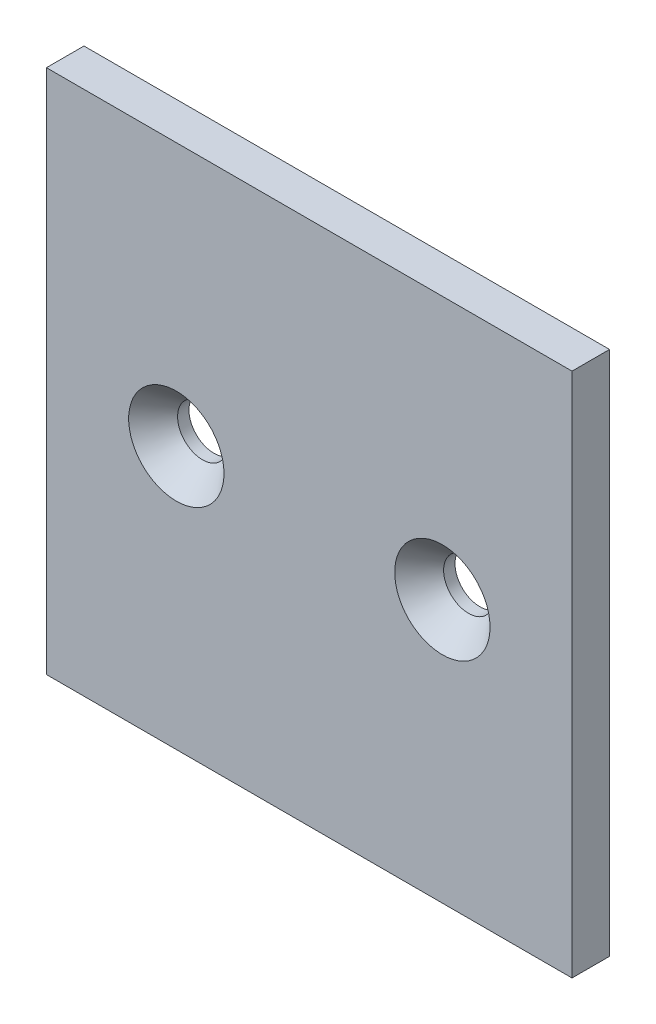
ISO-10303-21;
HEADER;
FILE_DESCRIPTION(('STEP AP214'),'2;1');
FILE_NAME('part.step','',(''),(''),'','','');
FILE_SCHEMA(('AUTOMOTIVE_DESIGN { 1 0 10303 214 1 1 1 1 }'));
ENDSEC;
DATA;
#1=APPLICATION_CONTEXT('core data for automotive mechanical design processes');
#2=APPLICATION_PROTOCOL_DEFINITION('international standard','automotive_design',2000,#1);
#3=PRODUCT_CONTEXT('',#1,'mechanical');
#4=PRODUCT('Part','Part','',(#3));
#5=PRODUCT_RELATED_PRODUCT_CATEGORY('part','',(#4));
#6=PRODUCT_DEFINITION_FORMATION('','',#4);
#7=PRODUCT_DEFINITION_CONTEXT('part definition',#1,'design');
#8=PRODUCT_DEFINITION('design','',#6,#7);
#9=PRODUCT_DEFINITION_SHAPE('','',#8);
#10=(LENGTH_UNIT() NAMED_UNIT(*) SI_UNIT(.MILLI.,.METRE.));
#11=(NAMED_UNIT(*) PLANE_ANGLE_UNIT() SI_UNIT($,.RADIAN.));
#12=(NAMED_UNIT(*) SI_UNIT($,.STERADIAN.) SOLID_ANGLE_UNIT());
#13=UNCERTAINTY_MEASURE_WITH_UNIT(LENGTH_MEASURE(1.E-05),#10,'distance_accuracy_value','');
#14=(GEOMETRIC_REPRESENTATION_CONTEXT(3) GLOBAL_UNCERTAINTY_ASSIGNED_CONTEXT((#13)) GLOBAL_UNIT_ASSIGNED_CONTEXT((#10,
#11,#12)) REPRESENTATION_CONTEXT('',''));
#15=CARTESIAN_POINT('',(0.,0.,0.));
#16=DIRECTION('',(0.,0.,1.));
#17=DIRECTION('',(1.,0.,0.));
#18=AXIS2_PLACEMENT_3D('',#15,#16,#17);
#19=CARTESIAN_POINT('',(44.45,44.45,-6.35));
#20=DIRECTION('',(1.,0.,0.));
#21=DIRECTION('',(0.,1.,0.));
#22=AXIS2_PLACEMENT_3D('',#19,#20,#21);
#23=PLANE('',#22);
#24=DIRECTION('',(0.,1.,0.));
#25=VECTOR('',#24,1.);
#26=CARTESIAN_POINT('',(44.45,44.45,0.));
#27=LINE('',#26,#25);
#28=CARTESIAN_POINT('',(44.45,-44.45,0.));
#29=VERTEX_POINT('',#28);
#30=CARTESIAN_POINT('',(44.45,44.45,0.));
#31=VERTEX_POINT('',#30);
#32=EDGE_CURVE('E100',#29,#31,#27,.T.);
#33=ORIENTED_EDGE('',*,*,#32,.F.);
#34=DIRECTION('',(0.,0.,1.));
#35=VECTOR('',#34,1.);
#36=CARTESIAN_POINT('',(44.45,-44.45,-6.35));
#37=LINE('',#36,#35);
#38=CARTESIAN_POINT('',(44.45,-44.45,-6.35));
#39=VERTEX_POINT('',#38);
#40=EDGE_CURVE('E11',#39,#29,#37,.T.);
#41=ORIENTED_EDGE('',*,*,#40,.F.);
#42=DIRECTION('',(0.,1.,0.));
#43=VECTOR('',#42,1.);
#44=CARTESIAN_POINT('',(44.45,44.45,-6.35));
#45=LINE('',#44,#43);
#46=CARTESIAN_POINT('',(44.45,44.45,-6.35));
#47=VERTEX_POINT('',#46);
#48=EDGE_CURVE('E93',#39,#47,#45,.T.);
#49=ORIENTED_EDGE('',*,*,#48,.T.);
#50=DIRECTION('',(0.,0.,1.));
#51=VECTOR('',#50,1.);
#52=CARTESIAN_POINT('',(44.45,44.45,-6.35));
#53=LINE('',#52,#51);
#54=EDGE_CURVE('E76',#47,#31,#53,.T.);
#55=ORIENTED_EDGE('',*,*,#54,.T.);
#56=EDGE_LOOP('',(#33,#41,#49,#55));
#57=FACE_BOUND('',#56,.T.);
#58=ADVANCED_FACE('F33',(#57),#23,.T.);
#59=CARTESIAN_POINT('',(-44.45,-44.45,-6.35));
#60=DIRECTION('',(0.,-1.,0.));
#61=DIRECTION('',(0.,0.,-1.));
#62=AXIS2_PLACEMENT_3D('',#59,#60,#61);
#63=PLANE('',#62);
#64=DIRECTION('',(1.,0.,0.));
#65=VECTOR('',#64,1.);
#66=CARTESIAN_POINT('',(-44.45,-44.45,0.));
#67=LINE('',#66,#65);
#68=CARTESIAN_POINT('',(-44.45,-44.45,0.));
#69=VERTEX_POINT('',#68);
#70=EDGE_CURVE('E95',#69,#29,#67,.T.);
#71=ORIENTED_EDGE('',*,*,#70,.F.);
#72=DIRECTION('',(0.,0.,1.));
#73=VECTOR('',#72,1.);
#74=CARTESIAN_POINT('',(-44.45,-44.45,-6.35));
#75=LINE('',#74,#73);
#76=CARTESIAN_POINT('',(-44.45,-44.45,-6.35));
#77=VERTEX_POINT('',#76);
#78=EDGE_CURVE('E42',#77,#69,#75,.T.);
#79=ORIENTED_EDGE('',*,*,#78,.F.);
#80=DIRECTION('',(1.,0.,0.));
#81=VECTOR('',#80,1.);
#82=CARTESIAN_POINT('',(-44.45,-44.45,-6.35));
#83=LINE('',#82,#81);
#84=EDGE_CURVE('E90',#77,#39,#83,.T.);
#85=ORIENTED_EDGE('',*,*,#84,.T.);
#86=ORIENTED_EDGE('',*,*,#40,.T.);
#87=EDGE_LOOP('',(#71,#79,#85,#86));
#88=FACE_BOUND('',#87,.T.);
#89=ADVANCED_FACE('F137',(#88),#63,.T.);
#90=CARTESIAN_POINT('',(-44.45,44.45,-6.35));
#91=DIRECTION('',(-1.,0.,0.));
#92=DIRECTION('',(0.,-1.,0.));
#93=AXIS2_PLACEMENT_3D('',#90,#91,#92);
#94=PLANE('',#93);
#95=DIRECTION('',(0.,-1.,0.));
#96=VECTOR('',#95,1.);
#97=CARTESIAN_POINT('',(-44.45,44.45,0.));
#98=LINE('',#97,#96);
#99=CARTESIAN_POINT('',(-44.45,44.45,0.));
#100=VERTEX_POINT('',#99);
#101=EDGE_CURVE('E84',#100,#69,#98,.T.);
#102=ORIENTED_EDGE('',*,*,#101,.F.);
#103=DIRECTION('',(0.,0.,1.));
#104=VECTOR('',#103,1.);
#105=CARTESIAN_POINT('',(-44.45,44.45,-6.35));
#106=LINE('',#105,#104);
#107=CARTESIAN_POINT('',(-44.45,44.45,-6.35));
#108=VERTEX_POINT('',#107);
#109=EDGE_CURVE('E79',#108,#100,#106,.T.);
#110=ORIENTED_EDGE('',*,*,#109,.F.);
#111=DIRECTION('',(0.,-1.,0.));
#112=VECTOR('',#111,1.);
#113=CARTESIAN_POINT('',(-44.45,44.45,-6.35));
#114=LINE('',#113,#112);
#115=EDGE_CURVE('E82',#108,#77,#114,.T.);
#116=ORIENTED_EDGE('',*,*,#115,.T.);
#117=ORIENTED_EDGE('',*,*,#78,.T.);
#118=EDGE_LOOP('',(#102,#110,#116,#117));
#119=FACE_BOUND('',#118,.T.);
#120=ADVANCED_FACE('F81',(#119),#94,.T.);
#121=CARTESIAN_POINT('',(-44.45,44.45,-6.35));
#122=DIRECTION('',(0.,1.,0.));
#123=DIRECTION('',(0.,0.,1.));
#124=AXIS2_PLACEMENT_3D('',#121,#122,#123);
#125=PLANE('',#124);
#126=DIRECTION('',(-1.,0.,0.));
#127=VECTOR('',#126,1.);
#128=CARTESIAN_POINT('',(-44.45,44.45,0.));
#129=LINE('',#128,#127);
#130=EDGE_CURVE('E103',#31,#100,#129,.T.);
#131=ORIENTED_EDGE('',*,*,#130,.F.);
#132=ORIENTED_EDGE('',*,*,#54,.F.);
#133=DIRECTION('',(-1.,0.,0.));
#134=VECTOR('',#133,1.);
#135=CARTESIAN_POINT('',(-44.45,44.45,-6.35));
#136=LINE('',#135,#134);
#137=EDGE_CURVE('E89',#47,#108,#136,.T.);
#138=ORIENTED_EDGE('',*,*,#137,.T.);
#139=ORIENTED_EDGE('',*,*,#109,.T.);
#140=EDGE_LOOP('',(#131,#132,#138,#139));
#141=FACE_BOUND('',#140,.T.);
#142=ADVANCED_FACE('F92',(#141),#125,.T.);
#143=CARTESIAN_POINT('',(0.,0.,-6.35));
#144=DIRECTION('',(0.,0.,1.));
#145=DIRECTION('',(1.,0.,0.));
#146=AXIS2_PLACEMENT_3D('',#143,#144,#145);
#147=PLANE('',#146);
#148=CARTESIAN_POINT('',(-22.479,0.,-6.35));
#149=DIRECTION('',(0.,0.,1.));
#150=DIRECTION('',(1.,0.,0.));
#151=AXIS2_PLACEMENT_3D('',#148,#149,#150);
#152=CIRCLE('',#151,4.21639999999999);
#153=CARTESIAN_POINT('',(-18.2626,0.,-6.35));
#154=VERTEX_POINT('',#153);
#155=EDGE_CURVE('E36',#154,#154,#152,.T.);
#156=ORIENTED_EDGE('',*,*,#155,.T.);
#157=EDGE_LOOP('',(#156));
#158=FACE_BOUND('',#157,.T.);
#159=CARTESIAN_POINT('',(22.521,0.,-6.35));
#160=DIRECTION('',(0.,0.,1.));
#161=DIRECTION('',(1.,0.,0.));
#162=AXIS2_PLACEMENT_3D('',#159,#160,#161);
#163=CIRCLE('',#162,4.21639999999999);
#164=CARTESIAN_POINT('',(26.7374,0.,-6.35));
#165=VERTEX_POINT('',#164);
#166=EDGE_CURVE('E104',#165,#165,#163,.T.);
#167=ORIENTED_EDGE('',*,*,#166,.T.);
#168=EDGE_LOOP('',(#167));
#169=FACE_BOUND('',#168,.T.);
#170=ORIENTED_EDGE('',*,*,#48,.F.);
#171=ORIENTED_EDGE('',*,*,#84,.F.);
#172=ORIENTED_EDGE('',*,*,#115,.F.);
#173=ORIENTED_EDGE('',*,*,#137,.F.);
#174=EDGE_LOOP('',(#170,#171,#172,#173));
#175=FACE_BOUND('',#174,.T.);
#176=ADVANCED_FACE('F88',(#158,#169,#175),#147,.F.);
#177=CARTESIAN_POINT('',(0.,0.,0.));
#178=DIRECTION('',(0.,0.,1.));
#179=DIRECTION('',(1.,0.,0.));
#180=AXIS2_PLACEMENT_3D('',#177,#178,#179);
#181=PLANE('',#180);
#182=CARTESIAN_POINT('',(-22.479,0.,0.));
#183=DIRECTION('',(0.,0.,1.));
#184=DIRECTION('',(1.,0.,0.));
#185=AXIS2_PLACEMENT_3D('',#182,#183,#184);
#186=CIRCLE('',#185,8.0645);
#187=CARTESIAN_POINT('',(-14.4145,0.,0.));
#188=VERTEX_POINT('',#187);
#189=EDGE_CURVE('E124',#188,#188,#186,.T.);
#190=ORIENTED_EDGE('',*,*,#189,.F.);
#191=EDGE_LOOP('',(#190));
#192=FACE_BOUND('',#191,.T.);
#193=CARTESIAN_POINT('',(22.521,0.,0.));
#194=DIRECTION('',(0.,0.,1.));
#195=DIRECTION('',(1.,0.,0.));
#196=AXIS2_PLACEMENT_3D('',#193,#194,#195);
#197=CIRCLE('',#196,8.0645);
#198=CARTESIAN_POINT('',(30.5855,0.,0.));
#199=VERTEX_POINT('',#198);
#200=EDGE_CURVE('E115',#199,#199,#197,.T.);
#201=ORIENTED_EDGE('',*,*,#200,.F.);
#202=EDGE_LOOP('',(#201));
#203=FACE_BOUND('',#202,.T.);
#204=ORIENTED_EDGE('',*,*,#32,.T.);
#205=ORIENTED_EDGE('',*,*,#130,.T.);
#206=ORIENTED_EDGE('',*,*,#101,.T.);
#207=ORIENTED_EDGE('',*,*,#70,.T.);
#208=EDGE_LOOP('',(#204,#205,#206,#207));
#209=FACE_BOUND('',#208,.T.);
#210=ADVANCED_FACE('F130',(#192,#203,#209),#181,.T.);
#211=CARTESIAN_POINT('',(22.521,0.,0.));
#212=DIRECTION('',(0.,0.,1.));
#213=DIRECTION('',(1.,0.,0.));
#214=AXIS2_PLACEMENT_3D('',#211,#212,#213);
#215=CYLINDRICAL_SURFACE('',#214,4.21639999999999);
#216=CARTESIAN_POINT('',(22.521,0.,-4.42673266782717));
#217=DIRECTION('',(0.,0.,1.));
#218=DIRECTION('',(1.,0.,0.));
#219=AXIS2_PLACEMENT_3D('',#216,#217,#218);
#220=CIRCLE('',#219,4.21639999999999);
#221=CARTESIAN_POINT('',(26.7374,0.,-4.42673266782717));
#222=VERTEX_POINT('',#221);
#223=EDGE_CURVE('E111',#222,#222,#220,.T.);
#224=ORIENTED_EDGE('',*,*,#223,.T.);
#225=EDGE_LOOP('',(#224));
#226=FACE_BOUND('',#225,.T.);
#227=ORIENTED_EDGE('',*,*,#166,.F.);
#228=EDGE_LOOP('',(#227));
#229=FACE_BOUND('',#228,.T.);
#230=ADVANCED_FACE('F133',(#226,#229),#215,.F.);
#231=CARTESIAN_POINT('',(22.521,0.,0.));
#232=DIRECTION('',(0.,0.,1.));
#233=DIRECTION('',(1.,0.,0.));
#234=AXIS2_PLACEMENT_3D('',#231,#232,#233);
#235=CONICAL_SURFACE('',#234,8.0645,0.715584993317676);
#236=ORIENTED_EDGE('',*,*,#223,.F.);
#237=EDGE_LOOP('',(#236));
#238=FACE_BOUND('',#237,.T.);
#239=ORIENTED_EDGE('',*,*,#200,.T.);
#240=EDGE_LOOP('',(#239));
#241=FACE_BOUND('',#240,.T.);
#242=ADVANCED_FACE('F157',(#238,#241),#235,.F.);
#243=CARTESIAN_POINT('',(-22.479,0.,0.));
#244=DIRECTION('',(0.,0.,1.));
#245=DIRECTION('',(1.,0.,0.));
#246=AXIS2_PLACEMENT_3D('',#243,#244,#245);
#247=CYLINDRICAL_SURFACE('',#246,4.21639999999999);
#248=CARTESIAN_POINT('',(-22.479,0.,-4.42673266782717));
#249=DIRECTION('',(0.,0.,1.));
#250=DIRECTION('',(1.,0.,0.));
#251=AXIS2_PLACEMENT_3D('',#248,#249,#250);
#252=CIRCLE('',#251,4.21639999999999);
#253=CARTESIAN_POINT('',(-18.2626,0.,-4.42673266782717));
#254=VERTEX_POINT('',#253);
#255=EDGE_CURVE('E121',#254,#254,#252,.T.);
#256=ORIENTED_EDGE('',*,*,#255,.T.);
#257=EDGE_LOOP('',(#256));
#258=FACE_BOUND('',#257,.T.);
#259=ORIENTED_EDGE('',*,*,#155,.F.);
#260=EDGE_LOOP('',(#259));
#261=FACE_BOUND('',#260,.T.);
#262=ADVANCED_FACE('F160',(#258,#261),#247,.F.);
#263=CARTESIAN_POINT('',(-22.479,0.,0.));
#264=DIRECTION('',(0.,0.,1.));
#265=DIRECTION('',(1.,0.,0.));
#266=AXIS2_PLACEMENT_3D('',#263,#264,#265);
#267=CONICAL_SURFACE('',#266,8.0645,0.715584993317676);
#268=ORIENTED_EDGE('',*,*,#255,.F.);
#269=EDGE_LOOP('',(#268));
#270=FACE_BOUND('',#269,.T.);
#271=ORIENTED_EDGE('',*,*,#189,.T.);
#272=EDGE_LOOP('',(#271));
#273=FACE_BOUND('',#272,.T.);
#274=ADVANCED_FACE('F128',(#270,#273),#267,.F.);
#275=CLOSED_SHELL('',(#58,#89,#120,#142,#176,#210,#230,#242,#262,#274));
#276=MANIFOLD_SOLID_BREP('B2',#275);
#277=ADVANCED_BREP_SHAPE_REPRESENTATION('',(#18,#276),#14);
#278=SHAPE_DEFINITION_REPRESENTATION(#9,#277);
ENDSEC;
END-ISO-10303-21;
